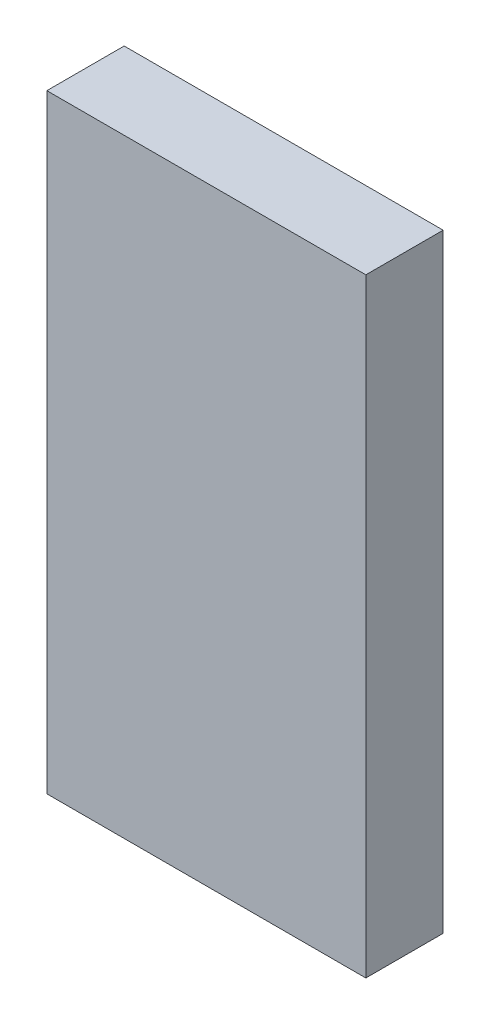
ISO-10303-21;
HEADER;
FILE_DESCRIPTION(('STEP AP214'),'2;1');
FILE_NAME('part.step','',(''),(''),'','','');
FILE_SCHEMA(('AUTOMOTIVE_DESIGN { 1 0 10303 214 1 1 1 1 }'));
ENDSEC;
DATA;
#1=APPLICATION_CONTEXT('core data for automotive mechanical design processes');
#2=APPLICATION_PROTOCOL_DEFINITION('international standard','automotive_design',2000,#1);
#3=PRODUCT_CONTEXT('',#1,'mechanical');
#4=PRODUCT('Part','Part','',(#3));
#5=PRODUCT_RELATED_PRODUCT_CATEGORY('part','',(#4));
#6=PRODUCT_DEFINITION_FORMATION('','',#4);
#7=PRODUCT_DEFINITION_CONTEXT('part definition',#1,'design');
#8=PRODUCT_DEFINITION('design','',#6,#7);
#9=PRODUCT_DEFINITION_SHAPE('','',#8);
#10=(LENGTH_UNIT() NAMED_UNIT(*) SI_UNIT(.MILLI.,.METRE.));
#11=(NAMED_UNIT(*) PLANE_ANGLE_UNIT() SI_UNIT($,.RADIAN.));
#12=(NAMED_UNIT(*) SI_UNIT($,.STERADIAN.) SOLID_ANGLE_UNIT());
#13=UNCERTAINTY_MEASURE_WITH_UNIT(LENGTH_MEASURE(1.E-05),#10,'distance_accuracy_value','');
#14=(GEOMETRIC_REPRESENTATION_CONTEXT(3) GLOBAL_UNCERTAINTY_ASSIGNED_CONTEXT((#13)) GLOBAL_UNIT_ASSIGNED_CONTEXT((#10,
#11,#12)) REPRESENTATION_CONTEXT('',''));
#15=CARTESIAN_POINT('',(0.,0.,0.));
#16=DIRECTION('',(0.,0.,1.));
#17=DIRECTION('',(1.,0.,0.));
#18=AXIS2_PLACEMENT_3D('',#15,#16,#17);
#19=CARTESIAN_POINT('',(14.0221929811177,-13.8940277297927,1.03674100901396E-06));
#20=DIRECTION('',(0.,8.74227339409095E-08,-1.));
#21=DIRECTION('',(1.19248806384999E-08,1.,8.74227339409095E-08));
#22=AXIS2_PLACEMENT_3D('',#19,#20,#21);
#23=PLANE('',#22);
#24=DIRECTION('',(-1.19248807761764E-08,-1.,-8.74227339409095E-08));
#25=VECTOR('',#24,1.);
#26=CARTESIAN_POINT('',(12.3721929811177,-13.8940277101167,1.03674101074869E-06));
#27=LINE('',#26,#25);
#28=CARTESIAN_POINT('',(12.3721930186811,-10.7440277101167,1.3121226227937E-06));
#29=VERTEX_POINT('',#28);
#30=CARTESIAN_POINT('',(12.3721929435543,-17.0440277101166,7.61359398703671E-07));
#31=VERTEX_POINT('',#30);
#32=EDGE_CURVE('E90',#29,#31,#27,.T.);
#33=ORIENTED_EDGE('',*,*,#32,.T.);
#34=DIRECTION('',(1.,-1.19248806384999E-08,0.));
#35=VECTOR('',#34,1.);
#36=CARTESIAN_POINT('',(14.0221929435543,-17.0440277297927,7.61359396968947E-07));
#37=LINE('',#36,#35);
#38=CARTESIAN_POINT('',(15.6721929435543,-17.0440277494687,7.61359395234224E-07));
#39=VERTEX_POINT('',#38);
#40=EDGE_CURVE('E27',#31,#39,#37,.T.);
#41=ORIENTED_EDGE('',*,*,#40,.T.);
#42=DIRECTION('',(-1.19248807761764E-08,-1.,-8.74227339409095E-08));
#43=VECTOR('',#42,1.);
#44=CARTESIAN_POINT('',(15.6721929811177,-13.8940277494688,1.03674100727924E-06));
#45=LINE('',#44,#43);
#46=CARTESIAN_POINT('',(15.672193018681,-10.7440277494688,1.31212261932426E-06));
#47=VERTEX_POINT('',#46);
#48=EDGE_CURVE('E78',#47,#39,#45,.T.);
#49=ORIENTED_EDGE('',*,*,#48,.F.);
#50=DIRECTION('',(1.,-1.19248806384999E-08,0.));
#51=VECTOR('',#50,1.);
#52=CARTESIAN_POINT('',(14.022193018681,-10.7440277297927,1.31212262105898E-06));
#53=LINE('',#52,#51);
#54=EDGE_CURVE('E101',#29,#47,#53,.T.);
#55=ORIENTED_EDGE('',*,*,#54,.F.);
#56=EDGE_LOOP('',(#33,#41,#49,#55));
#57=FACE_BOUND('',#56,.T.);
#58=ADVANCED_FACE('F17',(#57),#23,.F.);
#59=CARTESIAN_POINT('',(14.0221929811177,-13.8940276598545,-0.799998963258989));
#60=DIRECTION('',(0.,8.74227339409095E-08,-1.));
#61=DIRECTION('',(1.19248806384999E-08,1.,8.74227339409095E-08));
#62=AXIS2_PLACEMENT_3D('',#59,#60,#61);
#63=PLANE('',#62);
#64=DIRECTION('',(-1.19248807761764E-08,-1.,-8.74227339409095E-08));
#65=VECTOR('',#64,1.);
#66=CARTESIAN_POINT('',(12.3721929811177,-13.8940276401785,-0.799998963258987));
#67=LINE('',#66,#65);
#68=CARTESIAN_POINT('',(12.3721930186811,-10.7440276401785,-0.799998687877375));
#69=VERTEX_POINT('',#68);
#70=CARTESIAN_POINT('',(12.3721929435543,-17.0440276401785,-0.799999238640599));
#71=VERTEX_POINT('',#70);
#72=EDGE_CURVE('E81',#69,#71,#67,.T.);
#73=ORIENTED_EDGE('',*,*,#72,.F.);
#74=DIRECTION('',(1.,-1.19248806384999E-08,0.));
#75=VECTOR('',#74,1.);
#76=CARTESIAN_POINT('',(14.022193018681,-10.7440276598545,-0.799998687877377));
#77=LINE('',#76,#75);
#78=CARTESIAN_POINT('',(15.672193018681,-10.7440276795306,-0.799998687877378));
#79=VERTEX_POINT('',#78);
#80=EDGE_CURVE('E67',#69,#79,#77,.T.);
#81=ORIENTED_EDGE('',*,*,#80,.T.);
#82=DIRECTION('',(-1.19248807761764E-08,-1.,-8.74227339409095E-08));
#83=VECTOR('',#82,1.);
#84=CARTESIAN_POINT('',(15.6721929811177,-13.8940276795306,-0.799998963258991));
#85=LINE('',#84,#83);
#86=CARTESIAN_POINT('',(15.6721929435543,-17.0440276795306,-0.799999238640603));
#87=VERTEX_POINT('',#86);
#88=EDGE_CURVE('E111',#79,#87,#85,.T.);
#89=ORIENTED_EDGE('',*,*,#88,.T.);
#90=DIRECTION('',(1.,-1.19248806384999E-08,0.));
#91=VECTOR('',#90,1.);
#92=CARTESIAN_POINT('',(14.0221929435543,-17.0440276598545,-0.799999238640601));
#93=LINE('',#92,#91);
#94=EDGE_CURVE('E11',#71,#87,#93,.T.);
#95=ORIENTED_EDGE('',*,*,#94,.F.);
#96=EDGE_LOOP('',(#73,#81,#89,#95));
#97=FACE_BOUND('',#96,.T.);
#98=ADVANCED_FACE('F82',(#97),#63,.T.);
#99=CARTESIAN_POINT('',(14.0221929435543,-17.0440276598545,-0.799999238640601));
#100=DIRECTION('',(-1.19248806384999E-08,-1.,-8.74227339409095E-08));
#101=DIRECTION('',(0.,8.74227339409095E-08,-1.));
#102=AXIS2_PLACEMENT_3D('',#99,#100,#101);
#103=PLANE('',#102);
#104=ORIENTED_EDGE('',*,*,#40,.F.);
#105=DIRECTION('',(0.,-8.74227339409095E-08,1.));
#106=VECTOR('',#105,1.);
#107=CARTESIAN_POINT('',(12.3721929435543,-17.0440276401785,-0.799999238640599));
#108=LINE('',#107,#106);
#109=EDGE_CURVE('E86',#71,#31,#108,.T.);
#110=ORIENTED_EDGE('',*,*,#109,.F.);
#111=ORIENTED_EDGE('',*,*,#94,.T.);
#112=DIRECTION('',(0.,-8.74227339409095E-08,1.));
#113=VECTOR('',#112,1.);
#114=CARTESIAN_POINT('',(15.6721929435543,-17.0440276795306,-0.799999238640603));
#115=LINE('',#114,#113);
#116=EDGE_CURVE('E108',#87,#39,#115,.T.);
#117=ORIENTED_EDGE('',*,*,#116,.T.);
#118=EDGE_LOOP('',(#104,#110,#111,#117));
#119=FACE_BOUND('',#118,.T.);
#120=ADVANCED_FACE('F140',(#119),#103,.T.);
#121=CARTESIAN_POINT('',(15.6721929811177,-13.8940276795306,-0.799998963258991));
#122=DIRECTION('',(-1.,1.19248807761763E-08,0.));
#123=DIRECTION('',(1.19248807761764E-08,1.,8.74227339409095E-08));
#124=AXIS2_PLACEMENT_3D('',#121,#122,#123);
#125=PLANE('',#124);
#126=ORIENTED_EDGE('',*,*,#48,.T.);
#127=ORIENTED_EDGE('',*,*,#116,.F.);
#128=ORIENTED_EDGE('',*,*,#88,.F.);
#129=DIRECTION('',(0.,-8.74227339409095E-08,1.));
#130=VECTOR('',#129,1.);
#131=CARTESIAN_POINT('',(15.672193018681,-10.7440276795306,-0.799998687877378));
#132=LINE('',#131,#130);
#133=EDGE_CURVE('E75',#79,#47,#132,.T.);
#134=ORIENTED_EDGE('',*,*,#133,.T.);
#135=EDGE_LOOP('',(#126,#127,#128,#134));
#136=FACE_BOUND('',#135,.T.);
#137=ADVANCED_FACE('F139',(#136),#125,.F.);
#138=CARTESIAN_POINT('',(14.022193018681,-10.7440276598545,-0.799998687877377));
#139=DIRECTION('',(-1.19248806384999E-08,-1.,-8.74227339409095E-08));
#140=DIRECTION('',(0.,8.74227339409095E-08,-1.));
#141=AXIS2_PLACEMENT_3D('',#138,#139,#140);
#142=PLANE('',#141);
#143=ORIENTED_EDGE('',*,*,#54,.T.);
#144=ORIENTED_EDGE('',*,*,#133,.F.);
#145=ORIENTED_EDGE('',*,*,#80,.F.);
#146=DIRECTION('',(0.,-8.74227339409095E-08,1.));
#147=VECTOR('',#146,1.);
#148=CARTESIAN_POINT('',(12.3721930186811,-10.7440276401785,-0.799998687877375));
#149=LINE('',#148,#147);
#150=EDGE_CURVE('E72',#69,#29,#149,.T.);
#151=ORIENTED_EDGE('',*,*,#150,.T.);
#152=EDGE_LOOP('',(#143,#144,#145,#151));
#153=FACE_BOUND('',#152,.T.);
#154=ADVANCED_FACE('F70',(#153),#142,.F.);
#155=CARTESIAN_POINT('',(12.3721929811177,-13.8940276401785,-0.799998963258987));
#156=DIRECTION('',(-1.,1.19248807761763E-08,0.));
#157=DIRECTION('',(1.19248807761764E-08,1.,8.74227339409095E-08));
#158=AXIS2_PLACEMENT_3D('',#155,#156,#157);
#159=PLANE('',#158);
#160=ORIENTED_EDGE('',*,*,#32,.F.);
#161=ORIENTED_EDGE('',*,*,#150,.F.);
#162=ORIENTED_EDGE('',*,*,#72,.T.);
#163=ORIENTED_EDGE('',*,*,#109,.T.);
#164=EDGE_LOOP('',(#160,#161,#162,#163));
#165=FACE_BOUND('',#164,.T.);
#166=ADVANCED_FACE('F88',(#165),#159,.T.);
#167=CLOSED_SHELL('',(#58,#98,#120,#137,#154,#166));
#168=MANIFOLD_SOLID_BREP('B1',#167);
#169=ADVANCED_BREP_SHAPE_REPRESENTATION('',(#18,#168),#14);
#170=SHAPE_DEFINITION_REPRESENTATION(#9,#169);
ENDSEC;
END-ISO-10303-21;
